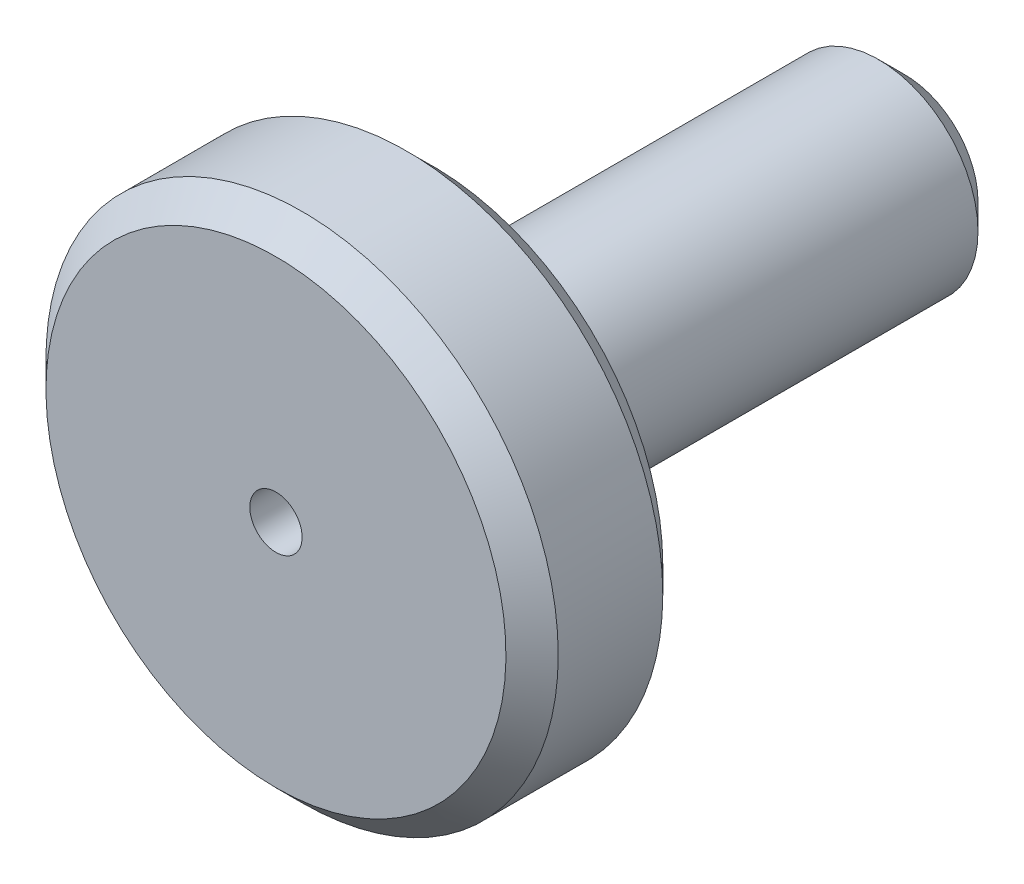
ISO-10303-21;
HEADER;
FILE_DESCRIPTION(('STEP AP214'),'2;1');
FILE_NAME('part.step','',(''),(''),'','','');
FILE_SCHEMA(('AUTOMOTIVE_DESIGN { 1 0 10303 214 1 1 1 1 }'));
ENDSEC;
DATA;
#1=APPLICATION_CONTEXT('core data for automotive mechanical design processes');
#2=APPLICATION_PROTOCOL_DEFINITION('international standard','automotive_design',2000,#1);
#3=PRODUCT_CONTEXT('',#1,'mechanical');
#4=PRODUCT('Part','Part','',(#3));
#5=PRODUCT_RELATED_PRODUCT_CATEGORY('part','',(#4));
#6=PRODUCT_DEFINITION_FORMATION('','',#4);
#7=PRODUCT_DEFINITION_CONTEXT('part definition',#1,'design');
#8=PRODUCT_DEFINITION('design','',#6,#7);
#9=PRODUCT_DEFINITION_SHAPE('','',#8);
#10=(LENGTH_UNIT() NAMED_UNIT(*) SI_UNIT(.MILLI.,.METRE.));
#11=(NAMED_UNIT(*) PLANE_ANGLE_UNIT() SI_UNIT($,.RADIAN.));
#12=(NAMED_UNIT(*) SI_UNIT($,.STERADIAN.) SOLID_ANGLE_UNIT());
#13=UNCERTAINTY_MEASURE_WITH_UNIT(LENGTH_MEASURE(1.E-05),#10,'distance_accuracy_value','');
#14=(GEOMETRIC_REPRESENTATION_CONTEXT(3) GLOBAL_UNCERTAINTY_ASSIGNED_CONTEXT((#13)) GLOBAL_UNIT_ASSIGNED_CONTEXT((#10,
#11,#12)) REPRESENTATION_CONTEXT('',''));
#15=CARTESIAN_POINT('',(0.,0.,0.));
#16=DIRECTION('',(0.,0.,1.));
#17=DIRECTION('',(1.,0.,0.));
#18=AXIS2_PLACEMENT_3D('',#15,#16,#17);
#19=CARTESIAN_POINT('',(-1.70705152999218E-05,52.9250012088693,16.8592929112564));
#20=DIRECTION('',(0.,0.,-1.));
#21=DIRECTION('',(-1.,0.,0.));
#22=AXIS2_PLACEMENT_3D('',#19,#20,#21);
#23=CYLINDRICAL_SURFACE('',#22,4.9);
#24=CARTESIAN_POINT('',(-1.70705152999218E-05,52.9250012088693,0.5));
#25=DIRECTION('',(0.,0.,1.));
#26=DIRECTION('',(1.,0.,0.));
#27=AXIS2_PLACEMENT_3D('',#24,#25,#26);
#28=CIRCLE('',#27,4.9);
#29=CARTESIAN_POINT('',(4.8999829294847,52.9250012088693,0.5));
#30=VERTEX_POINT('',#29);
#31=EDGE_CURVE('E53',#30,#30,#28,.T.);
#32=ORIENTED_EDGE('',*,*,#31,.T.);
#33=EDGE_LOOP('',(#32));
#34=FACE_BOUND('',#33,.T.);
#35=CARTESIAN_POINT('',(-1.70705152999218E-05,52.9250012088693,2.50000000000007));
#36=DIRECTION('',(0.,0.,1.));
#37=DIRECTION('',(1.,0.,0.));
#38=AXIS2_PLACEMENT_3D('',#35,#36,#37);
#39=CIRCLE('',#38,4.9);
#40=CARTESIAN_POINT('',(4.8999829294847,52.9250012088693,2.50000000000007));
#41=VERTEX_POINT('',#40);
#42=EDGE_CURVE('E57',#41,#41,#39,.F.);
#43=ORIENTED_EDGE('',*,*,#42,.T.);
#44=EDGE_LOOP('',(#43));
#45=FACE_BOUND('',#44,.T.);
#46=ADVANCED_FACE('F41',(#34,#45),#23,.T.);
#47=CARTESIAN_POINT('',(0.,0.,0.));
#48=DIRECTION('',(0.,0.,1.));
#49=DIRECTION('',(1.,0.,0.));
#50=AXIS2_PLACEMENT_3D('',#47,#48,#49);
#51=PLANE('',#50);
#52=CARTESIAN_POINT('',(-1.70705152999218E-05,52.9250012088693,0.));
#53=DIRECTION('',(0.,0.,1.));
#54=DIRECTION('',(1.,0.,0.));
#55=AXIS2_PLACEMENT_3D('',#52,#53,#54);
#56=CIRCLE('',#55,4.4);
#57=CARTESIAN_POINT('',(4.3999829294847,52.9250012088693,0.));
#58=VERTEX_POINT('',#57);
#59=EDGE_CURVE('E49',#58,#58,#56,.F.);
#60=ORIENTED_EDGE('',*,*,#59,.T.);
#61=EDGE_LOOP('',(#60));
#62=FACE_BOUND('',#61,.T.);
#63=CARTESIAN_POINT('',(-1.70705152999218E-05,52.9250012088693,0.));
#64=DIRECTION('',(0.,0.,1.));
#65=DIRECTION('',(1.,0.,0.));
#66=AXIS2_PLACEMENT_3D('',#63,#64,#65);
#67=CIRCLE('',#66,2.4);
#68=CARTESIAN_POINT('',(2.3999829294847,52.9250012088693,0.));
#69=VERTEX_POINT('',#68);
#70=EDGE_CURVE('E71',#69,#69,#67,.T.);
#71=ORIENTED_EDGE('',*,*,#70,.T.);
#72=EDGE_LOOP('',(#71));
#73=FACE_BOUND('',#72,.T.);
#74=ADVANCED_FACE('F87',(#62,#73),#51,.F.);
#75=CARTESIAN_POINT('',(-1.7070514959916E-05,52.9250012088695,3.00000000000006));
#76=DIRECTION('',(0.,0.,1.));
#77=DIRECTION('',(0.827854487607383,-0.560942909170191,0.));
#78=AXIS2_PLACEMENT_3D('',#75,#76,#77);
#79=PLANE('',#78);
#80=CARTESIAN_POINT('',(-1.70705152979887E-05,52.9250012088693,2.99999999999999));
#81=DIRECTION('',(0.,0.,1.));
#82=DIRECTION('',(1.,0.,0.));
#83=AXIS2_PLACEMENT_3D('',#80,#81,#82);
#84=CIRCLE('',#83,0.500000000000001);
#85=CARTESIAN_POINT('',(0.499982929484703,52.9250012088693,2.99999999999999));
#86=VERTEX_POINT('',#85);
#87=EDGE_CURVE('E77',#86,#86,#84,.T.);
#88=ORIENTED_EDGE('',*,*,#87,.F.);
#89=EDGE_LOOP('',(#88));
#90=FACE_BOUND('',#89,.T.);
#91=CARTESIAN_POINT('',(-1.70705152999218E-05,52.9250012088693,3.00000000000006));
#92=DIRECTION('',(0.,0.,1.));
#93=DIRECTION('',(0.,-1.,0.));
#94=AXIS2_PLACEMENT_3D('',#91,#92,#93);
#95=CIRCLE('',#94,4.40000000000001);
#96=CARTESIAN_POINT('',(-1.70705152999218E-05,48.5250012088693,3.00000000000006));
#97=VERTEX_POINT('',#96);
#98=EDGE_CURVE('E10',#97,#97,#95,.T.);
#99=ORIENTED_EDGE('',*,*,#98,.T.);
#100=EDGE_LOOP('',(#99));
#101=FACE_BOUND('',#100,.T.);
#102=ADVANCED_FACE('F84',(#90,#101),#79,.T.);
#103=CARTESIAN_POINT('',(-1.70705152999218E-05,52.9250012088693,-9.03));
#104=DIRECTION('',(0.,0.,1.));
#105=DIRECTION('',(1.,0.,0.));
#106=AXIS2_PLACEMENT_3D('',#103,#104,#105);
#107=CYLINDRICAL_SURFACE('',#106,1.9);
#108=CARTESIAN_POINT('',(-1.70705152999218E-05,52.9250012088693,-8.53));
#109=DIRECTION('',(0.,0.,1.));
#110=DIRECTION('',(1.,0.,0.));
#111=AXIS2_PLACEMENT_3D('',#108,#109,#110);
#112=CIRCLE('',#111,1.9);
#113=CARTESIAN_POINT('',(1.8999829294847,52.9250012088693,-8.53));
#114=VERTEX_POINT('',#113);
#115=EDGE_CURVE('E65',#114,#114,#112,.T.);
#116=ORIENTED_EDGE('',*,*,#115,.T.);
#117=EDGE_LOOP('',(#116));
#118=FACE_BOUND('',#117,.T.);
#119=CARTESIAN_POINT('',(-1.70705152999218E-05,52.9250012088693,-0.5));
#120=DIRECTION('',(0.,0.,1.));
#121=DIRECTION('',(1.,0.,0.));
#122=AXIS2_PLACEMENT_3D('',#119,#120,#121);
#123=CIRCLE('',#122,1.9);
#124=CARTESIAN_POINT('',(1.8999829294847,52.9250012088693,-0.5));
#125=VERTEX_POINT('',#124);
#126=EDGE_CURVE('E68',#125,#125,#123,.F.);
#127=ORIENTED_EDGE('',*,*,#126,.T.);
#128=EDGE_LOOP('',(#127));
#129=FACE_BOUND('',#128,.T.);
#130=ADVANCED_FACE('F86',(#118,#129),#107,.T.);
#131=CARTESIAN_POINT('',(0.,0.,-9.03));
#132=DIRECTION('',(0.,0.,1.));
#133=DIRECTION('',(1.,0.,0.));
#134=AXIS2_PLACEMENT_3D('',#131,#132,#133);
#135=PLANE('',#134);
#136=CARTESIAN_POINT('',(-1.70705152979887E-05,52.9250012088693,-9.03));
#137=DIRECTION('',(0.,0.,1.));
#138=DIRECTION('',(1.,0.,0.));
#139=AXIS2_PLACEMENT_3D('',#136,#137,#138);
#140=CIRCLE('',#139,0.500000000000001);
#141=CARTESIAN_POINT('',(0.499982929484703,52.9250012088693,-9.03));
#142=VERTEX_POINT('',#141);
#143=EDGE_CURVE('E74',#142,#142,#140,.F.);
#144=ORIENTED_EDGE('',*,*,#143,.F.);
#145=EDGE_LOOP('',(#144));
#146=FACE_BOUND('',#145,.T.);
#147=CARTESIAN_POINT('',(-1.70705152999218E-05,52.9250012088693,-9.03));
#148=DIRECTION('',(0.,0.,1.));
#149=DIRECTION('',(1.,0.,0.));
#150=AXIS2_PLACEMENT_3D('',#147,#148,#149);
#151=CIRCLE('',#150,1.4);
#152=CARTESIAN_POINT('',(1.3999829294847,52.9250012088693,-9.03));
#153=VERTEX_POINT('',#152);
#154=EDGE_CURVE('E62',#153,#153,#151,.F.);
#155=ORIENTED_EDGE('',*,*,#154,.T.);
#156=EDGE_LOOP('',(#155));
#157=FACE_BOUND('',#156,.T.);
#158=ADVANCED_FACE('F93',(#146,#157),#135,.F.);
#159=CARTESIAN_POINT('',(-1.70705152999218E-05,52.9250012088693,-0.5));
#160=DIRECTION('',(0.,0.,1.));
#161=DIRECTION('',(1.,0.,0.));
#162=AXIS2_PLACEMENT_3D('',#159,#160,#161);
#163=TOROIDAL_SURFACE('',#162,2.4,0.5);
#164=ORIENTED_EDGE('',*,*,#126,.F.);
#165=EDGE_LOOP('',(#164));
#166=FACE_BOUND('',#165,.T.);
#167=ORIENTED_EDGE('',*,*,#70,.F.);
#168=EDGE_LOOP('',(#167));
#169=FACE_BOUND('',#168,.T.);
#170=ADVANCED_FACE('F107',(#166,#169),#163,.F.);
#171=CARTESIAN_POINT('',(-1.70705152999218E-05,52.9250012088693,-8.53));
#172=DIRECTION('',(0.,0.,1.));
#173=DIRECTION('',(1.,0.,0.));
#174=AXIS2_PLACEMENT_3D('',#171,#172,#173);
#175=CONICAL_SURFACE('',#174,1.9,0.785398163397449);
#176=ORIENTED_EDGE('',*,*,#154,.F.);
#177=EDGE_LOOP('',(#176));
#178=FACE_BOUND('',#177,.T.);
#179=ORIENTED_EDGE('',*,*,#115,.F.);
#180=EDGE_LOOP('',(#179));
#181=FACE_BOUND('',#180,.T.);
#182=ADVANCED_FACE('F118',(#178,#181),#175,.T.);
#183=CARTESIAN_POINT('',(-1.70705152999218E-05,52.9250012088693,0.5));
#184=DIRECTION('',(0.,0.,1.));
#185=DIRECTION('',(1.,0.,0.));
#186=AXIS2_PLACEMENT_3D('',#183,#184,#185);
#187=CONICAL_SURFACE('',#186,4.9,0.785398163397452);
#188=ORIENTED_EDGE('',*,*,#59,.F.);
#189=EDGE_LOOP('',(#188));
#190=FACE_BOUND('',#189,.T.);
#191=ORIENTED_EDGE('',*,*,#31,.F.);
#192=EDGE_LOOP('',(#191));
#193=FACE_BOUND('',#192,.T.);
#194=ADVANCED_FACE('F113',(#190,#193),#187,.T.);
#195=CARTESIAN_POINT('',(-1.70705152999218E-05,52.9250012088693,3.00000000000006));
#196=DIRECTION('',(0.,0.,-1.));
#197=DIRECTION('',(-1.,0.,0.));
#198=AXIS2_PLACEMENT_3D('',#195,#196,#197);
#199=CONICAL_SURFACE('',#198,4.40000000000001,0.785398163397447);
#200=ORIENTED_EDGE('',*,*,#42,.F.);
#201=EDGE_LOOP('',(#200));
#202=FACE_BOUND('',#201,.T.);
#203=ORIENTED_EDGE('',*,*,#98,.F.);
#204=EDGE_LOOP('',(#203));
#205=FACE_BOUND('',#204,.T.);
#206=ADVANCED_FACE('F44',(#202,#205),#199,.T.);
#207=CARTESIAN_POINT('',(-1.70705152979887E-05,52.9250012088693,-9.031));
#208=DIRECTION('',(0.,0.,1.));
#209=DIRECTION('',(1.,0.,0.));
#210=AXIS2_PLACEMENT_3D('',#207,#208,#209);
#211=CYLINDRICAL_SURFACE('',#210,0.500000000000001);
#212=ORIENTED_EDGE('',*,*,#87,.T.);
#213=EDGE_LOOP('',(#212));
#214=FACE_BOUND('',#213,.T.);
#215=ORIENTED_EDGE('',*,*,#143,.T.);
#216=EDGE_LOOP('',(#215));
#217=FACE_BOUND('',#216,.T.);
#218=ADVANCED_FACE('F81',(#214,#217),#211,.F.);
#219=CLOSED_SHELL('',(#46,#74,#102,#130,#158,#170,#182,#194,#206,#218));
#220=MANIFOLD_SOLID_BREP('B2',#219);
#221=ADVANCED_BREP_SHAPE_REPRESENTATION('',(#18,#220),#14);
#222=SHAPE_DEFINITION_REPRESENTATION(#9,#221);
ENDSEC;
END-ISO-10303-21;
